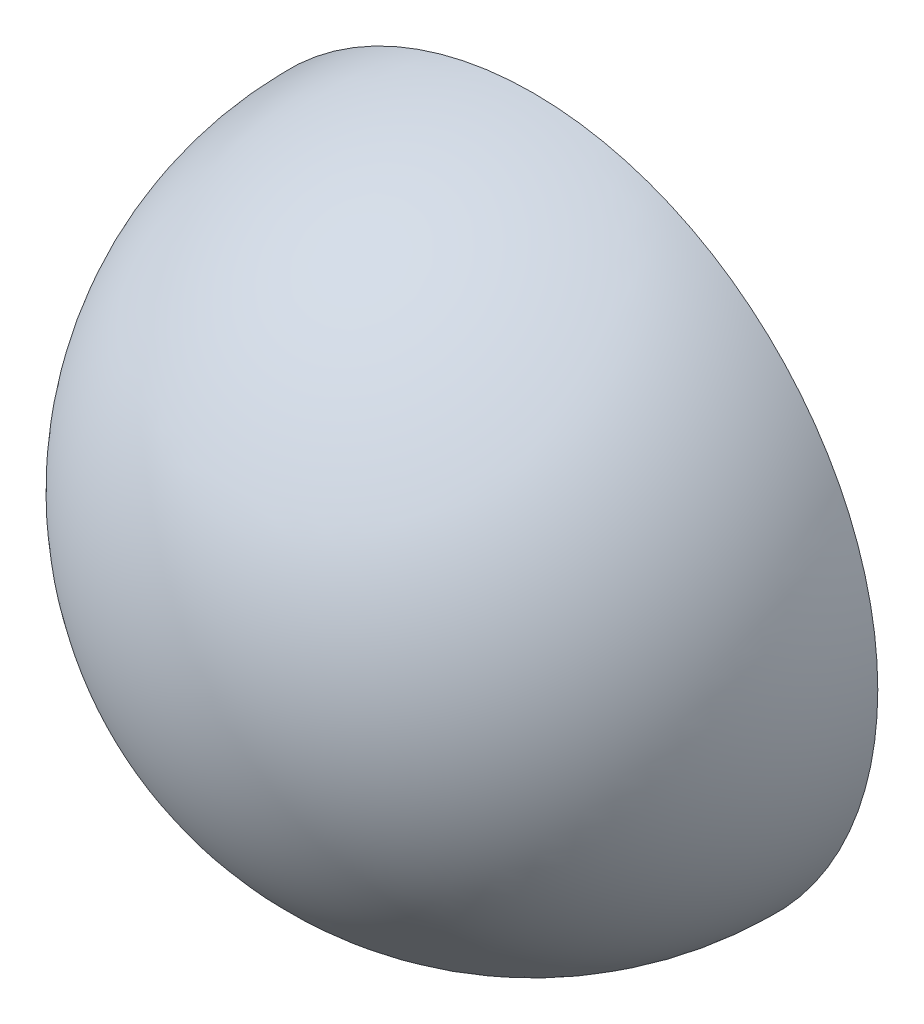
ISO-10303-21;
HEADER;
FILE_DESCRIPTION(('STEP AP214'),'2;1');
FILE_NAME('part.step','',(''),(''),'','','');
FILE_SCHEMA(('AUTOMOTIVE_DESIGN { 1 0 10303 214 1 1 1 1 }'));
ENDSEC;
DATA;
#1=APPLICATION_CONTEXT('core data for automotive mechanical design processes');
#2=APPLICATION_PROTOCOL_DEFINITION('international standard','automotive_design',2000,#1);
#3=PRODUCT_CONTEXT('',#1,'mechanical');
#4=PRODUCT('Part','Part','',(#3));
#5=PRODUCT_RELATED_PRODUCT_CATEGORY('part','',(#4));
#6=PRODUCT_DEFINITION_FORMATION('','',#4);
#7=PRODUCT_DEFINITION_CONTEXT('part definition',#1,'design');
#8=PRODUCT_DEFINITION('design','',#6,#7);
#9=PRODUCT_DEFINITION_SHAPE('','',#8);
#10=(LENGTH_UNIT() NAMED_UNIT(*) SI_UNIT(.MILLI.,.METRE.));
#11=(NAMED_UNIT(*) PLANE_ANGLE_UNIT() SI_UNIT($,.RADIAN.));
#12=(NAMED_UNIT(*) SI_UNIT($,.STERADIAN.) SOLID_ANGLE_UNIT());
#13=UNCERTAINTY_MEASURE_WITH_UNIT(LENGTH_MEASURE(1.E-05),#10,'distance_accuracy_value','');
#14=(GEOMETRIC_REPRESENTATION_CONTEXT(3) GLOBAL_UNCERTAINTY_ASSIGNED_CONTEXT((#13)) GLOBAL_UNIT_ASSIGNED_CONTEXT((#10,
#11,#12)) REPRESENTATION_CONTEXT('',''));
#15=CARTESIAN_POINT('',(0.,0.,0.));
#16=DIRECTION('',(0.,0.,1.));
#17=DIRECTION('',(1.,0.,0.));
#18=AXIS2_PLACEMENT_3D('',#15,#16,#17);
#19=CARTESIAN_POINT('',(-1.,0.,0.));
#20=DIRECTION('',(0.,0.,1.));
#21=DIRECTION('',(1.,0.,0.));
#22=AXIS2_PLACEMENT_3D('',#19,#20,#21);
#23=PLANE('',#22);
#24=CARTESIAN_POINT('',(0.,0.,0.));
#25=DIRECTION('',(0.,0.,1.));
#26=DIRECTION('',(1.,0.,0.));
#27=AXIS2_PLACEMENT_3D('',#24,#25,#26);
#28=CIRCLE('',#27,1.);
#29=CARTESIAN_POINT('',(1.,0.,0.));
#30=VERTEX_POINT('',#29);
#31=EDGE_CURVE('E10',#30,#30,#28,.T.);
#32=ORIENTED_EDGE('',*,*,#31,.F.);
#33=EDGE_LOOP('',(#32));
#34=FACE_BOUND('',#33,.T.);
#35=ADVANCED_FACE('F33',(#34),#23,.F.);
#36=CARTESIAN_POINT('',(0.,0.,0.));
#37=DIRECTION('',(0.,0.,1.));
#38=DIRECTION('',(-1.,0.,0.));
#39=AXIS2_PLACEMENT_3D('',#36,#37,#38);
#40=SPHERICAL_SURFACE('',#39,1.);
#41=ORIENTED_EDGE('',*,*,#31,.T.);
#42=EDGE_LOOP('',(#41));
#43=FACE_BOUND('',#42,.T.);
#44=ADVANCED_FACE('F40',(#43),#40,.T.);
#45=CLOSED_SHELL('',(#35,#44));
#46=MANIFOLD_SOLID_BREP('B2',#45);
#47=ADVANCED_BREP_SHAPE_REPRESENTATION('',(#18,#46),#14);
#48=SHAPE_DEFINITION_REPRESENTATION(#9,#47);
ENDSEC;
END-ISO-10303-21;
